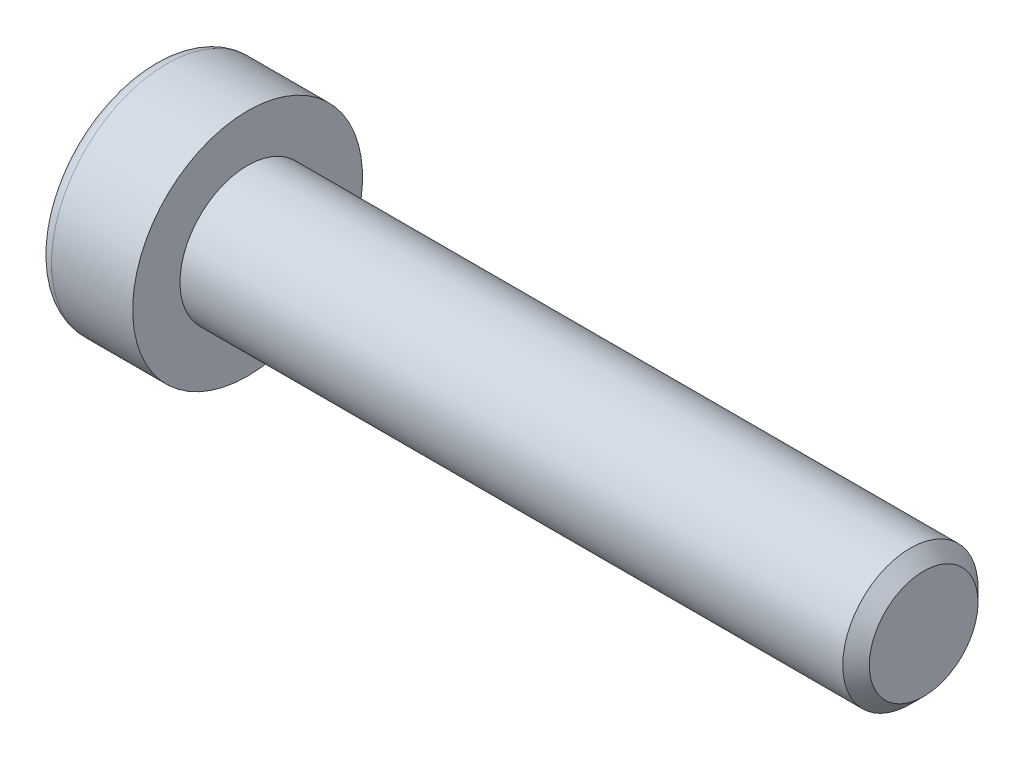
ISO-10303-21;
HEADER;
FILE_DESCRIPTION(('STEP AP214'),'2;1');
FILE_NAME('part.step','',(''),(''),'','','');
FILE_SCHEMA(('AUTOMOTIVE_DESIGN { 1 0 10303 214 1 1 1 1 }'));
ENDSEC;
DATA;
#1=APPLICATION_CONTEXT('core data for automotive mechanical design processes');
#2=APPLICATION_PROTOCOL_DEFINITION('international standard','automotive_design',2000,#1);
#3=PRODUCT_CONTEXT('',#1,'mechanical');
#4=PRODUCT('Part','Part','',(#3));
#5=PRODUCT_RELATED_PRODUCT_CATEGORY('part','',(#4));
#6=PRODUCT_DEFINITION_FORMATION('','',#4);
#7=PRODUCT_DEFINITION_CONTEXT('part definition',#1,'design');
#8=PRODUCT_DEFINITION('design','',#6,#7);
#9=PRODUCT_DEFINITION_SHAPE('','',#8);
#10=(LENGTH_UNIT() NAMED_UNIT(*) SI_UNIT(.MILLI.,.METRE.));
#11=(NAMED_UNIT(*) PLANE_ANGLE_UNIT() SI_UNIT($,.RADIAN.));
#12=(NAMED_UNIT(*) SI_UNIT($,.STERADIAN.) SOLID_ANGLE_UNIT());
#13=UNCERTAINTY_MEASURE_WITH_UNIT(LENGTH_MEASURE(1.E-05),#10,'distance_accuracy_value','');
#14=(GEOMETRIC_REPRESENTATION_CONTEXT(3) GLOBAL_UNCERTAINTY_ASSIGNED_CONTEXT((#13)) GLOBAL_UNIT_ASSIGNED_CONTEXT((#10,
#11,#12)) REPRESENTATION_CONTEXT('',''));
#15=CARTESIAN_POINT('',(0.,0.,0.));
#16=DIRECTION('',(0.,0.,1.));
#17=DIRECTION('',(1.,0.,0.));
#18=AXIS2_PLACEMENT_3D('',#15,#16,#17);
#19=CARTESIAN_POINT('',(-3.5,-1.5,0.866025403784439));
#20=DIRECTION('',(0.,-0.5,0.866025403784439));
#21=DIRECTION('',(0.,-0.866025403784439,-0.5));
#22=AXIS2_PLACEMENT_3D('',#19,#20,#21);
#23=PLANE('',#22);
#24=DIRECTION('',(1.,0.,0.));
#25=VECTOR('',#24,1.);
#26=CARTESIAN_POINT('',(-3.5,-1.5,0.866025403784438));
#27=LINE('',#26,#25);
#28=CARTESIAN_POINT('',(-0.799999988867068,-1.49999996233255,0.866025425531749));
#29=VERTEX_POINT('',#28);
#30=CARTESIAN_POINT('',(-3.5,-1.5,0.866025403784438));
#31=VERTEX_POINT('',#30);
#32=EDGE_CURVE('E78',#29,#31,#27,.F.);
#33=ORIENTED_EDGE('',*,*,#32,.T.);
#34=DIRECTION('',(0.,-0.866025403784439,-0.5));
#35=VECTOR('',#34,1.);
#36=CARTESIAN_POINT('',(-3.5,-1.5,0.866025403784439));
#37=LINE('',#36,#35);
#38=CARTESIAN_POINT('',(-3.5,0.,1.73205080756888));
#39=VERTEX_POINT('',#38);
#40=EDGE_CURVE('E90',#39,#31,#37,.T.);
#41=ORIENTED_EDGE('',*,*,#40,.F.);
#42=DIRECTION('',(1.,0.,0.));
#43=VECTOR('',#42,1.);
#44=CARTESIAN_POINT('',(-3.5,0.,1.73205080756888));
#45=LINE('',#44,#43);
#46=CARTESIAN_POINT('',(-0.799999997521485,1.17041970330491E-08,1.73205080081146));
#47=VERTEX_POINT('',#46);
#48=EDGE_CURVE('E73',#39,#47,#45,.T.);
#49=ORIENTED_EDGE('',*,*,#48,.T.);
#50=CARTESIAN_POINT('',(-0.800000004794053,-1.69571014179176E-08,1.73205077642877));
#51=CARTESIAN_POINT('',(-0.778021656696874,-0.0659159374438855,1.69399421567383));
#52=CARTESIAN_POINT('',(-0.758033503093598,-0.132400840652987,1.65560914452181));
#53=CARTESIAN_POINT('',(-0.723144784654454,-0.266521786306955,1.57817438455973));
#54=CARTESIAN_POINT('',(-0.708256560777632,-0.334160211038563,1.53912332031867));
#55=CARTESIAN_POINT('',(-0.685081966752258,-0.468598851907672,1.46150513374616));
#56=CARTESIAN_POINT('',(-0.67664133885179,-0.535378388716331,1.42294995058342));
#57=CARTESIAN_POINT('',(-0.666566875869104,-0.669251518013702,1.34565826362971));
#58=CARTESIAN_POINT('',(-0.664924696262234,-0.736344624244432,1.30692204058053));
#59=CARTESIAN_POINT('',(-0.668349720014557,-0.861700886716701,1.23454756863114));
#60=CARTESIAN_POINT('',(-0.672575966117477,-0.919982853711116,1.20089845932059));
#61=CARTESIAN_POINT('',(-0.685967975897171,-1.03616709970217,1.13381945363874));
#62=CARTESIAN_POINT('',(-0.695138309776003,-1.09406897714887,1.10038978910236));
#63=CARTESIAN_POINT('',(-0.718062369113586,-1.2104925736284,1.03317259433002));
#64=CARTESIAN_POINT('',(-0.731913222805025,-1.26899956512162,0.999393567043165));
#65=CARTESIAN_POINT('',(-0.763348804941712,-1.38514116892087,0.932339180828007));
#66=CARTESIAN_POINT('',(-0.780926152022884,-1.44277726798599,0.89906296351894));
#67=CARTESIAN_POINT('',(-0.799999976323267,-1.49999992470115,0.866025447258253));
#68=B_SPLINE_CURVE_WITH_KNOTS('',3,(#50,#51,#52,#53,#54,#55,#56,#57,#58,#59,#60,#61,#62,#63,#64,
#65,#66,#67),.UNSPECIFIED.,.F.,.F.,(4,2,2,2,2,2,2,2,4),(0.,0.237762010114539,0.476095365250291,
0.708530707823554,0.940680670783404,1.14278081101932,1.3450680891288,1.55184112920544,
1.75820836138337),.UNSPECIFIED.);
#69=EDGE_CURVE('E19',#47,#29,#68,.T.);
#70=ORIENTED_EDGE('',*,*,#69,.T.);
#71=EDGE_LOOP('',(#33,#41,#49,#70));
#72=FACE_BOUND('',#71,.T.);
#73=ADVANCED_FACE('F15',(#72),#23,.F.);
#74=CARTESIAN_POINT('',(-3.5,-1.5,-0.866025403784438));
#75=DIRECTION('',(0.,-1.,0.));
#76=DIRECTION('',(0.,0.,-1.));
#77=AXIS2_PLACEMENT_3D('',#74,#75,#76);
#78=PLANE('',#77);
#79=DIRECTION('',(1.,0.,0.));
#80=VECTOR('',#79,1.);
#81=CARTESIAN_POINT('',(-3.5,-1.5,-0.866025403784439));
#82=LINE('',#81,#80);
#83=CARTESIAN_POINT('',(-0.799999988871031,-1.5,-0.866025360303542));
#84=VERTEX_POINT('',#83);
#85=CARTESIAN_POINT('',(-3.5,-1.5,-0.866025403784438));
#86=VERTEX_POINT('',#85);
#87=EDGE_CURVE('E217',#84,#86,#82,.F.);
#88=ORIENTED_EDGE('',*,*,#87,.T.);
#89=DIRECTION('',(0.,0.,-1.));
#90=VECTOR('',#89,1.);
#91=CARTESIAN_POINT('',(-3.5,-1.5,-0.866025403784438));
#92=LINE('',#91,#90);
#93=EDGE_CURVE('E89',#31,#86,#92,.T.);
#94=ORIENTED_EDGE('',*,*,#93,.F.);
#95=ORIENTED_EDGE('',*,*,#32,.F.);
#96=CARTESIAN_POINT('',(-0.800000033434989,-1.49999996275919,0.866025430217359));
#97=CARTESIAN_POINT('',(-0.778021676301525,-1.49999998662477,0.789912288030923));
#98=CARTESIAN_POINT('',(-0.758033517947388,-1.49999999641521,0.71314213601303));
#99=CARTESIAN_POINT('',(-0.723144793881313,-1.5000000035934,0.558272606337249));
#100=CARTESIAN_POINT('',(-0.708256569131695,-1.50000000095129,0.480170477841771));
#101=CARTESIAN_POINT('',(-0.68508197255406,-1.49999999907226,0.324934102206935));
#102=CARTESIAN_POINT('',(-0.676641342974203,-1.49999999975269,0.247823733476011));
#103=CARTESIAN_POINT('',(-0.666566877161477,-1.500000000247,0.0932403552687408));
#104=CARTESIAN_POINT('',(-0.664924696406791,-1.50000000006194,0.01576790727506));
#105=CARTESIAN_POINT('',(-0.668349718342616,-1.49999999994608,-0.12898104146176));
#106=CARTESIAN_POINT('',(-0.672575963817816,-1.49999999998547,-0.196279262989629));
#107=CARTESIAN_POINT('',(-0.685967972836551,-1.50000000001455,-0.330437280109427));
#108=CARTESIAN_POINT('',(-0.695138306581063,-1.5000000000042,-0.397296612031607));
#109=CARTESIAN_POINT('',(-0.718062366109409,-1.49999999999571,-0.531731007513679));
#110=CARTESIAN_POINT('',(-0.731913220149705,-1.49999999999786,-0.599289065171955));
#111=CARTESIAN_POINT('',(-0.763348803360585,-1.50000000000214,-0.733397843717908));
#112=CARTESIAN_POINT('',(-0.780926151167941,-1.50000000000427,-0.799950281366898));
#113=CARTESIAN_POINT('',(-0.799999976331814,-1.5,-0.866025316866421));
#114=B_SPLINE_CURVE_WITH_KNOTS('',3,(#96,#97,#98,#99,#100,#101,#102,#103,#104,#105,#106,#107,
#108,#109,#110,#111,#112,#113),.UNSPECIFIED.,.F.,.F.,(4,2,2,2,2,2,2,2,4),(0.,0.237762017439527,
0.476095379639777,0.708530728272866,0.940680697404313,1.14278084610673,1.34506813262744,
1.55184118195675,1.75820842345583),.UNSPECIFIED.);
#115=EDGE_CURVE('E83',#29,#84,#114,.T.);
#116=ORIENTED_EDGE('',*,*,#115,.T.);
#117=EDGE_LOOP('',(#88,#94,#95,#116));
#118=FACE_BOUND('',#117,.T.);
#119=ADVANCED_FACE('F87',(#118),#78,.F.);
#120=CARTESIAN_POINT('',(-3.5,0.,1.73205080756888));
#121=DIRECTION('',(0.,0.500000000000001,0.866025403784438));
#122=DIRECTION('',(0.,-0.866025403784438,0.500000000000001));
#123=AXIS2_PLACEMENT_3D('',#120,#121,#122);
#124=PLANE('',#123);
#125=ORIENTED_EDGE('',*,*,#48,.F.);
#126=DIRECTION('',(0.,-0.866025403784438,0.500000000000001));
#127=VECTOR('',#126,1.);
#128=CARTESIAN_POINT('',(-3.5,0.,1.73205080756888));
#129=LINE('',#128,#127);
#130=CARTESIAN_POINT('',(-3.5,1.5,0.866025403784437));
#131=VERTEX_POINT('',#130);
#132=EDGE_CURVE('E220',#131,#39,#129,.T.);
#133=ORIENTED_EDGE('',*,*,#132,.F.);
#134=DIRECTION('',(1.,0.,0.));
#135=VECTOR('',#134,1.);
#136=CARTESIAN_POINT('',(-3.5,1.5,0.866025403784437));
#137=LINE('',#136,#135);
#138=CARTESIAN_POINT('',(-0.799999988867498,1.5,0.866025360291303));
#139=VERTEX_POINT('',#138);
#140=EDGE_CURVE('E84',#131,#139,#137,.T.);
#141=ORIENTED_EDGE('',*,*,#140,.T.);
#142=CARTESIAN_POINT('',(-0.800000033433567,1.50000000426921,0.8660253583187));
#143=CARTESIAN_POINT('',(-0.778021676295276,1.43408410149037,0.904081950088849));
#144=CARTESIAN_POINT('',(-0.758033517936987,1.36759920446941,0.942467034585691));
#145=CARTESIAN_POINT('',(-0.723144793864638,1.23347826105221,1.01990180566003));
#146=CARTESIAN_POINT('',(-0.708256569113062,1.16583983234576,1.05895286763048));
#147=CARTESIAN_POINT('',(-0.68508197254175,1.03140118651243,1.13657105382219));
#148=CARTESIAN_POINT('',(-0.676641342966919,0.96462164865295,1.1751262387674));
#149=CARTESIAN_POINT('',(-0.666566877160271,0.830748516405722,1.25241792827836));
#150=CARTESIAN_POINT('',(-0.664924696406481,0.763655408276764,1.29115415210369));
#151=CARTESIAN_POINT('',(-0.668349718457172,0.638299137294113,1.36352862876635));
#152=CARTESIAN_POINT('',(-0.67257596442367,0.580017163683088,1.39717774196506));
#153=CARTESIAN_POINT('',(-0.68596797510084,0.463832904503485,1.46425675531158));
#154=CARTESIAN_POINT('',(-0.695138310014093,0.40593102048483,1.49768642362438));
#155=CARTESIAN_POINT('',(-0.718062372456597,0.289507410578443,1.56490362613407));
#156=CARTESIAN_POINT('',(-0.73191322826342,0.231000412237723,1.59868265737804));
#157=CARTESIAN_POINT('',(-0.763348815391527,0.114858794941851,1.66573705139287));
#158=CARTESIAN_POINT('',(-0.780926165347246,0.0572226892272379,1.69901327254471));
#159=CARTESIAN_POINT('',(-0.799999992771162,2.59551646267856E-08,1.73205079258366));
#160=B_SPLINE_CURVE_WITH_KNOTS('',3,(#142,#143,#144,#145,#146,#147,#148,#149,#150,#151,#152,
#153,#154,#155,#156,#157,#158,#159),.UNSPECIFIED.,.F.,.F.,(4,2,2,2,2,2,2,2,4),(0.,
0.237762017496781,0.476095379761698,0.708530728335868,0.94068069740302,1.14278086052986,
1.34506816152837,1.55184122608726,1.75820848269998),.UNSPECIFIED.);
#161=EDGE_CURVE('E120',#139,#47,#160,.T.);
#162=ORIENTED_EDGE('',*,*,#161,.T.);
#163=EDGE_LOOP('',(#125,#133,#141,#162));
#164=FACE_BOUND('',#163,.T.);
#165=ADVANCED_FACE('F113',(#164),#124,.F.);
#166=CARTESIAN_POINT('',(-3.5,0.,-1.73205080756888));
#167=DIRECTION('',(0.,-0.5,-0.866025403784439));
#168=DIRECTION('',(0.,0.866025403784439,-0.5));
#169=AXIS2_PLACEMENT_3D('',#166,#167,#168);
#170=PLANE('',#169);
#171=DIRECTION('',(1.,0.,0.));
#172=VECTOR('',#171,1.);
#173=CARTESIAN_POINT('',(-3.5,0.,-1.73205080756888));
#174=LINE('',#173,#172);
#175=CARTESIAN_POINT('',(-0.799999993625576,-5.19317473650085E-08,-1.73205079406354));
#176=VERTEX_POINT('',#175);
#177=CARTESIAN_POINT('',(-3.5,0.,-1.73205080756888));
#178=VERTEX_POINT('',#177);
#179=EDGE_CURVE('E125',#176,#178,#174,.F.);
#180=ORIENTED_EDGE('',*,*,#179,.T.);
#181=DIRECTION('',(0.,0.866025403784439,-0.5));
#182=VECTOR('',#181,1.);
#183=CARTESIAN_POINT('',(-3.5,0.,-1.73205080756888));
#184=LINE('',#183,#182);
#185=EDGE_CURVE('E38',#86,#178,#184,.T.);
#186=ORIENTED_EDGE('',*,*,#185,.F.);
#187=ORIENTED_EDGE('',*,*,#87,.F.);
#188=CARTESIAN_POINT('',(-0.800000033429313,-1.5000000042963,-0.866025358321739));
#189=CARTESIAN_POINT('',(-0.778021676302421,-1.43408410152741,-0.904081950074176));
#190=CARTESIAN_POINT('',(-0.75803351795084,-1.3675992045205,-0.942467034557997));
#191=CARTESIAN_POINT('',(-0.723144793886204,-1.23347826113726,-1.01990180560912));
#192=CARTESIAN_POINT('',(-0.708256569135469,-1.16583983245078,-1.05895286756938));
#193=CARTESIAN_POINT('',(-0.685081972556364,-1.03140118662151,-1.13657105375968));
#194=CARTESIAN_POINT('',(-0.676641342976148,-0.964621648745721,-1.17512623871396));
#195=CARTESIAN_POINT('',(-0.666566877162353,-0.830748516463139,-1.25241792824509));
#196=CARTESIAN_POINT('',(-0.664924696406954,-0.763655408315126,-1.29115415208152));
#197=CARTESIAN_POINT('',(-0.668349718341486,-0.638299141479767,-1.36352862634979));
#198=CARTESIAN_POINT('',(-0.672575963816185,-0.580017172026168,-1.39717773714819));
#199=CARTESIAN_POINT('',(-0.685967972834059,-0.463832921092294,-1.46425674573402));
#200=CARTESIAN_POINT('',(-0.695138306578215,-0.405931041161778,-1.49768641168654));
#201=CARTESIAN_POINT('',(-0.718062366105987,-0.289507439526365,-1.56490360942098));
#202=CARTESIAN_POINT('',(-0.731913220146064,-0.23100044536442,-1.59868263825233));
#203=CARTESIAN_POINT('',(-0.763348803356627,-0.114858836274076,-1.6657370275297));
#204=CARTESIAN_POINT('',(-0.780926151163884,-0.0572227345867656,-1.69901324635637));
#205=CARTESIAN_POINT('',(-0.799999976327709,-7.52855253312281E-08,-1.73205076410276));
#206=B_SPLINE_CURVE_WITH_KNOTS('',3,(#188,#189,#190,#191,#192,#193,#194,#195,#196,#197,#198,
#199,#200,#201,#202,#203,#204,#205),.UNSPECIFIED.,.F.,.F.,(4,2,2,2,2,2,2,2,4),(0.,
0.237762017437609,0.476095379636302,0.708530728268337,0.940680697398584,1.14278084610309,
1.34506813262598,1.55184118195724,1.75820842345815),.UNSPECIFIED.);
#207=EDGE_CURVE('E96',#84,#176,#206,.T.);
#208=ORIENTED_EDGE('',*,*,#207,.T.);
#209=EDGE_LOOP('',(#180,#186,#187,#208));
#210=FACE_BOUND('',#209,.T.);
#211=ADVANCED_FACE('F116',(#210),#170,.F.);
#212=CARTESIAN_POINT('',(-3.5,1.5,0.866025403784437));
#213=DIRECTION('',(0.,1.,0.));
#214=DIRECTION('',(0.,0.,1.));
#215=AXIS2_PLACEMENT_3D('',#212,#213,#214);
#216=PLANE('',#215);
#217=ORIENTED_EDGE('',*,*,#140,.F.);
#218=DIRECTION('',(0.,0.,1.));
#219=VECTOR('',#218,1.);
#220=CARTESIAN_POINT('',(-3.5,1.5,0.866025403784437));
#221=LINE('',#220,#219);
#222=CARTESIAN_POINT('',(-3.5,1.5,-0.866025403784439));
#223=VERTEX_POINT('',#222);
#224=EDGE_CURVE('E213',#223,#131,#221,.T.);
#225=ORIENTED_EDGE('',*,*,#224,.F.);
#226=DIRECTION('',(1.,0.,0.));
#227=VECTOR('',#226,1.);
#228=CARTESIAN_POINT('',(-3.5,1.5,-0.866025403784439));
#229=LINE('',#228,#227);
#230=CARTESIAN_POINT('',(-0.800000001368559,1.5,-0.866025403596251));
#231=VERTEX_POINT('',#230);
#232=EDGE_CURVE('E204',#223,#231,#229,.T.);
#233=ORIENTED_EDGE('',*,*,#232,.T.);
#234=CARTESIAN_POINT('',(-0.800000001154136,1.50000000026491,-0.866025403454279));
#235=CARTESIAN_POINT('',(-0.778021660048943,1.50000000009515,-0.789912260141364));
#236=CARTESIAN_POINT('',(-0.758033509022436,1.5000000000255,-0.713142109270289));
#237=CARTESIAN_POINT('',(-0.723144791693316,1.49999999997444,-0.558272583727159));
#238=CARTESIAN_POINT('',(-0.708256566349069,1.49999999999323,-0.480170458219125));
#239=CARTESIAN_POINT('',(-0.685081970234259,1.5000000000066,-0.324934087631714));
#240=CARTESIAN_POINT('',(-0.676641341702514,1.50000000000176,-0.247823720966487));
#241=CARTESIAN_POINT('',(-0.666566877089259,1.49999999999824,-0.0932403471747105));
#242=CARTESIAN_POINT('',(-0.664924696478615,1.49999999999956,-0.015767901531159));
#243=CARTESIAN_POINT('',(-0.668349718474959,1.50000000000038,0.128981044687817));
#244=CARTESIAN_POINT('',(-0.672575964042955,1.5000000000001,0.196279266039076));
#245=CARTESIAN_POINT('',(-0.685967973189808,1.4999999999999,0.330437282853159));
#246=CARTESIAN_POINT('',(-0.695138306973846,1.49999999999997,0.397296614645791));
#247=CARTESIAN_POINT('',(-0.71806236652139,1.50000000000003,0.531731009611409));
#248=CARTESIAN_POINT('',(-0.731913220523855,1.50000000000002,0.599289066885838));
#249=CARTESIAN_POINT('',(-0.763348803593243,1.49999999999999,0.733397844592943));
#250=CARTESIAN_POINT('',(-0.780926151292484,1.49999999999997,0.799950281787972));
#251=CARTESIAN_POINT('',(-0.799999976324083,1.5,0.866025316839637));
#252=B_SPLINE_CURVE_WITH_KNOTS('',3,(#234,#235,#236,#237,#238,#239,#240,#241,#242,#243,#244,
#245,#246,#247,#248,#249,#250,#251),.UNSPECIFIED.,.F.,.F.,(4,2,2,2,2,2,2,2,4),(0.,
0.237762008631603,0.476095362696117,0.708530704661828,0.940680666845777,1.14278081501453,
1.34506810117545,1.5518411493544,1.75820838945523),.UNSPECIFIED.);
#253=EDGE_CURVE('E97',#231,#139,#252,.T.);
#254=ORIENTED_EDGE('',*,*,#253,.T.);
#255=EDGE_LOOP('',(#217,#225,#233,#254));
#256=FACE_BOUND('',#255,.T.);
#257=ADVANCED_FACE('F135',(#256),#216,.F.);
#258=CARTESIAN_POINT('',(-0.80600000103459,0.,0.));
#259=DIRECTION('',(-1.,0.,0.));
#260=DIRECTION('',(0.,0.,1.));
#261=AXIS2_PLACEMENT_3D('',#258,#259,#260);
#262=CONICAL_SURFACE('',#261,1.74244311170924,1.04719754984197);
#263=CARTESIAN_POINT('',(0.200000001427725,-1.13686837721616E-10,0.));
#264=VERTEX_POINT('',#263);
#265=VERTEX_LOOP('',#264);
#266=FACE_BOUND('',#265,.T.);
#267=ORIENTED_EDGE('',*,*,#253,.F.);
#268=CARTESIAN_POINT('',(-0.800000001154134,1.49999999984653,-0.866025404178943));
#269=CARTESIAN_POINT('',(-0.778021660038382,1.4340840840587,-0.904081975706894));
#270=CARTESIAN_POINT('',(-0.758033509003093,1.36759918308469,-0.942467051100864));
#271=CARTESIAN_POINT('',(-0.723144791660858,1.23347823959674,-1.01990181386864));
#272=CARTESIAN_POINT('',(-0.708256566312607,1.165839814789,-1.05895287666065));
#273=CARTESIAN_POINT('',(-0.685081970210198,1.03140117427002,-1.1365710619692));
#274=CARTESIAN_POINT('',(-0.676641341688346,0.964621637873208,-1.17512624527867));
#275=CARTESIAN_POINT('',(-0.666566877086974,0.83074850923666,-1.25241793213018));
#276=CARTESIAN_POINT('',(-0.664924696478011,0.763655403255479,-1.29115415493071));
#277=CARTESIAN_POINT('',(-0.668349718704072,0.638299130357656,-1.36352863283382));
#278=CARTESIAN_POINT('',(-0.672575965255319,0.580017152715343,-1.39717774831419));
#279=CARTESIAN_POINT('',(-0.685967977721396,0.463832885526248,-1.46425676625118));
#280=CARTESIAN_POINT('',(-0.695138313844609,0.405930997529957,-1.49768643687251));
#281=CARTESIAN_POINT('',(-0.718062379224753,0.289507379790228,-1.56490364391464));
#282=CARTESIAN_POINT('',(-0.731913236762889,0.23100037759508,-1.59868267738147));
#283=CARTESIAN_POINT('',(-0.763348827672567,0.114858752804272,-1.66573707571853));
#284=CARTESIAN_POINT('',(-0.780926179671749,0.0572226434477013,-1.69901329897057));
#285=CARTESIAN_POINT('',(-0.800000009226824,-2.34118217361701E-08,-1.7320508210857));
#286=B_SPLINE_CURVE_WITH_KNOTS('',3,(#268,#269,#270,#271,#272,#273,#274,#275,#276,#277,#278,
#279,#280,#281,#282,#283,#284,#285),.UNSPECIFIED.,.F.,.F.,(4,2,2,2,2,2,2,2,4),(0.,
0.237762008746921,0.476095362941565,0.708530704789954,0.940680666845832,1.14278084388537,
1.34506815902389,1.55184123768522,1.75820850803633),.UNSPECIFIED.);
#287=EDGE_CURVE('E126',#231,#176,#286,.T.);
#288=ORIENTED_EDGE('',*,*,#287,.T.);
#289=ORIENTED_EDGE('',*,*,#207,.F.);
#290=ORIENTED_EDGE('',*,*,#115,.F.);
#291=ORIENTED_EDGE('',*,*,#69,.F.);
#292=ORIENTED_EDGE('',*,*,#161,.F.);
#293=EDGE_LOOP('',(#267,#288,#289,#290,#291,#292));
#294=FACE_BOUND('',#293,.T.);
#295=ADVANCED_FACE('F94',(#266,#294),#262,.F.);
#296=CARTESIAN_POINT('',(-3.5,1.5,-0.866025403784439));
#297=DIRECTION('',(0.,0.5,-0.866025403784439));
#298=DIRECTION('',(0.,0.866025403784439,0.5));
#299=AXIS2_PLACEMENT_3D('',#296,#297,#298);
#300=PLANE('',#299);
#301=ORIENTED_EDGE('',*,*,#232,.F.);
#302=DIRECTION('',(0.,0.866025403784439,0.5));
#303=VECTOR('',#302,1.);
#304=CARTESIAN_POINT('',(-3.5,0.,-1.73205080756888));
#305=LINE('',#304,#303);
#306=EDGE_CURVE('E215',#178,#223,#305,.T.);
#307=ORIENTED_EDGE('',*,*,#306,.F.);
#308=ORIENTED_EDGE('',*,*,#179,.F.);
#309=ORIENTED_EDGE('',*,*,#287,.F.);
#310=EDGE_LOOP('',(#301,#307,#308,#309));
#311=FACE_BOUND('',#310,.T.);
#312=ADVANCED_FACE('F144',(#311),#300,.F.);
#313=CARTESIAN_POINT('',(-3.5,2.99102540378444,0.));
#314=DIRECTION('',(-1.,0.,0.));
#315=DIRECTION('',(0.,0.,1.));
#316=AXIS2_PLACEMENT_3D('',#313,#314,#315);
#317=PLANE('',#316);
#318=ORIENTED_EDGE('',*,*,#185,.T.);
#319=ORIENTED_EDGE('',*,*,#306,.T.);
#320=ORIENTED_EDGE('',*,*,#224,.T.);
#321=ORIENTED_EDGE('',*,*,#132,.T.);
#322=ORIENTED_EDGE('',*,*,#40,.T.);
#323=ORIENTED_EDGE('',*,*,#93,.T.);
#324=EDGE_LOOP('',(#318,#319,#320,#321,#322,#323));
#325=FACE_BOUND('',#324,.T.);
#326=CARTESIAN_POINT('',(-3.5,0.,0.));
#327=DIRECTION('',(1.,0.,0.));
#328=DIRECTION('',(0.,1.,0.));
#329=AXIS2_PLACEMENT_3D('',#326,#327,#328);
#330=CIRCLE('',#329,3.75);
#331=CARTESIAN_POINT('',(-3.5,3.75,0.));
#332=VERTEX_POINT('',#331);
#333=EDGE_CURVE('E191',#332,#332,#330,.T.);
#334=ORIENTED_EDGE('',*,*,#333,.F.);
#335=EDGE_LOOP('',(#334));
#336=FACE_BOUND('',#335,.T.);
#337=ADVANCED_FACE('F178',(#325,#336),#317,.T.);
#338=CARTESIAN_POINT('',(-3.,0.,0.));
#339=DIRECTION('',(1.,0.,0.));
#340=DIRECTION('',(0.,0.,-1.));
#341=AXIS2_PLACEMENT_3D('',#338,#339,#340);
#342=TOROIDAL_SURFACE('',#341,3.75,0.5);
#343=CARTESIAN_POINT('',(-3.,0.,0.));
#344=DIRECTION('',(1.,0.,0.));
#345=DIRECTION('',(0.,1.,0.));
#346=AXIS2_PLACEMENT_3D('',#343,#344,#345);
#347=CIRCLE('',#346,4.25);
#348=CARTESIAN_POINT('',(-3.,4.25,0.));
#349=VERTEX_POINT('',#348);
#350=EDGE_CURVE('E231',#349,#349,#347,.T.);
#351=ORIENTED_EDGE('',*,*,#350,.F.);
#352=EDGE_LOOP('',(#351));
#353=FACE_BOUND('',#352,.T.);
#354=ORIENTED_EDGE('',*,*,#333,.T.);
#355=EDGE_LOOP('',(#354));
#356=FACE_BOUND('',#355,.T.);
#357=ADVANCED_FACE('F172',(#353,#356),#342,.T.);
#358=CARTESIAN_POINT('',(-1.75,0.,0.));
#359=DIRECTION('',(1.,0.,0.));
#360=DIRECTION('',(0.,1.,0.));
#361=AXIS2_PLACEMENT_3D('',#358,#359,#360);
#362=CYLINDRICAL_SURFACE('',#361,4.25);
#363=ORIENTED_EDGE('',*,*,#350,.T.);
#364=EDGE_LOOP('',(#363));
#365=FACE_BOUND('',#364,.T.);
#366=CARTESIAN_POINT('',(0.,0.,0.));
#367=DIRECTION('',(1.,0.,0.));
#368=DIRECTION('',(0.,1.,0.));
#369=AXIS2_PLACEMENT_3D('',#366,#367,#368);
#370=CIRCLE('',#369,4.25);
#371=CARTESIAN_POINT('',(0.,4.25,0.));
#372=VERTEX_POINT('',#371);
#373=EDGE_CURVE('E229',#372,#372,#370,.T.);
#374=ORIENTED_EDGE('',*,*,#373,.F.);
#375=EDGE_LOOP('',(#374));
#376=FACE_BOUND('',#375,.T.);
#377=ADVANCED_FACE('F168',(#365,#376),#362,.T.);
#378=CARTESIAN_POINT('',(25.,1.25,0.));
#379=DIRECTION('',(1.,0.,0.));
#380=DIRECTION('',(0.,0.,-1.));
#381=AXIS2_PLACEMENT_3D('',#378,#379,#380);
#382=PLANE('',#381);
#383=CARTESIAN_POINT('',(25.0000000001478,0.,0.));
#384=DIRECTION('',(-1.,0.,0.));
#385=DIRECTION('',(0.,0.,1.));
#386=AXIS2_PLACEMENT_3D('',#383,#384,#385);
#387=CIRCLE('',#386,2.00924000023406);
#388=CARTESIAN_POINT('',(25.0000000001478,0.,2.00924000023406));
#389=VERTEX_POINT('',#388);
#390=EDGE_CURVE('E227',#389,#389,#387,.T.);
#391=ORIENTED_EDGE('',*,*,#390,.F.);
#392=EDGE_LOOP('',(#391));
#393=FACE_BOUND('',#392,.T.);
#394=ADVANCED_FACE('F164',(#393),#382,.T.);
#395=CARTESIAN_POINT('',(0.,3.375,0.));
#396=DIRECTION('',(1.,0.,0.));
#397=DIRECTION('',(0.,0.,-1.));
#398=AXIS2_PLACEMENT_3D('',#395,#396,#397);
#399=PLANE('',#398);
#400=CARTESIAN_POINT('',(0.,0.,0.));
#401=DIRECTION('',(1.,0.,0.));
#402=DIRECTION('',(0.,1.,0.));
#403=AXIS2_PLACEMENT_3D('',#400,#401,#402);
#404=CIRCLE('',#403,2.5);
#405=CARTESIAN_POINT('',(0.,2.5,0.));
#406=VERTEX_POINT('',#405);
#407=EDGE_CURVE('E29',#406,#406,#404,.T.);
#408=ORIENTED_EDGE('',*,*,#407,.F.);
#409=EDGE_LOOP('',(#408));
#410=FACE_BOUND('',#409,.T.);
#411=ORIENTED_EDGE('',*,*,#373,.T.);
#412=EDGE_LOOP('',(#411));
#413=FACE_BOUND('',#412,.T.);
#414=ADVANCED_FACE('F157',(#410,#413),#399,.T.);
#415=CARTESIAN_POINT('',(24.5092399998725,0.,0.));
#416=DIRECTION('',(-1.,0.,0.));
#417=DIRECTION('',(0.,0.,1.));
#418=AXIS2_PLACEMENT_3D('',#415,#416,#417);
#419=CONICAL_SURFACE('',#418,2.49999999965667,0.785398162528743);
#420=ORIENTED_EDGE('',*,*,#390,.T.);
#421=EDGE_LOOP('',(#420));
#422=FACE_BOUND('',#421,.T.);
#423=CARTESIAN_POINT('',(24.50924,0.,0.));
#424=DIRECTION('',(1.,0.,0.));
#425=DIRECTION('',(0.,1.,0.));
#426=AXIS2_PLACEMENT_3D('',#423,#424,#425);
#427=CIRCLE('',#426,2.5);
#428=CARTESIAN_POINT('',(24.50924,2.5,0.));
#429=VERTEX_POINT('',#428);
#430=EDGE_CURVE('E9',#429,#429,#427,.F.);
#431=ORIENTED_EDGE('',*,*,#430,.F.);
#432=EDGE_LOOP('',(#431));
#433=FACE_BOUND('',#432,.T.);
#434=ADVANCED_FACE('F150',(#422,#433),#419,.T.);
#435=CARTESIAN_POINT('',(13.7,0.,0.));
#436=DIRECTION('',(1.,0.,0.));
#437=DIRECTION('',(0.,1.,0.));
#438=AXIS2_PLACEMENT_3D('',#435,#436,#437);
#439=CYLINDRICAL_SURFACE('',#438,2.5);
#440=ORIENTED_EDGE('',*,*,#430,.T.);
#441=EDGE_LOOP('',(#440));
#442=FACE_BOUND('',#441,.T.);
#443=ORIENTED_EDGE('',*,*,#407,.T.);
#444=EDGE_LOOP('',(#443));
#445=FACE_BOUND('',#444,.T.);
#446=ADVANCED_FACE('F148',(#442,#445),#439,.T.);
#447=CLOSED_SHELL('',(#73,#119,#165,#211,#257,#295,#312,#337,#357,#377,#394,#414,#434,#446));
#448=MANIFOLD_SOLID_BREP('B1',#447);
#449=ADVANCED_BREP_SHAPE_REPRESENTATION('',(#18,#448),#14);
#450=SHAPE_DEFINITION_REPRESENTATION(#9,#449);
ENDSEC;
END-ISO-10303-21;
